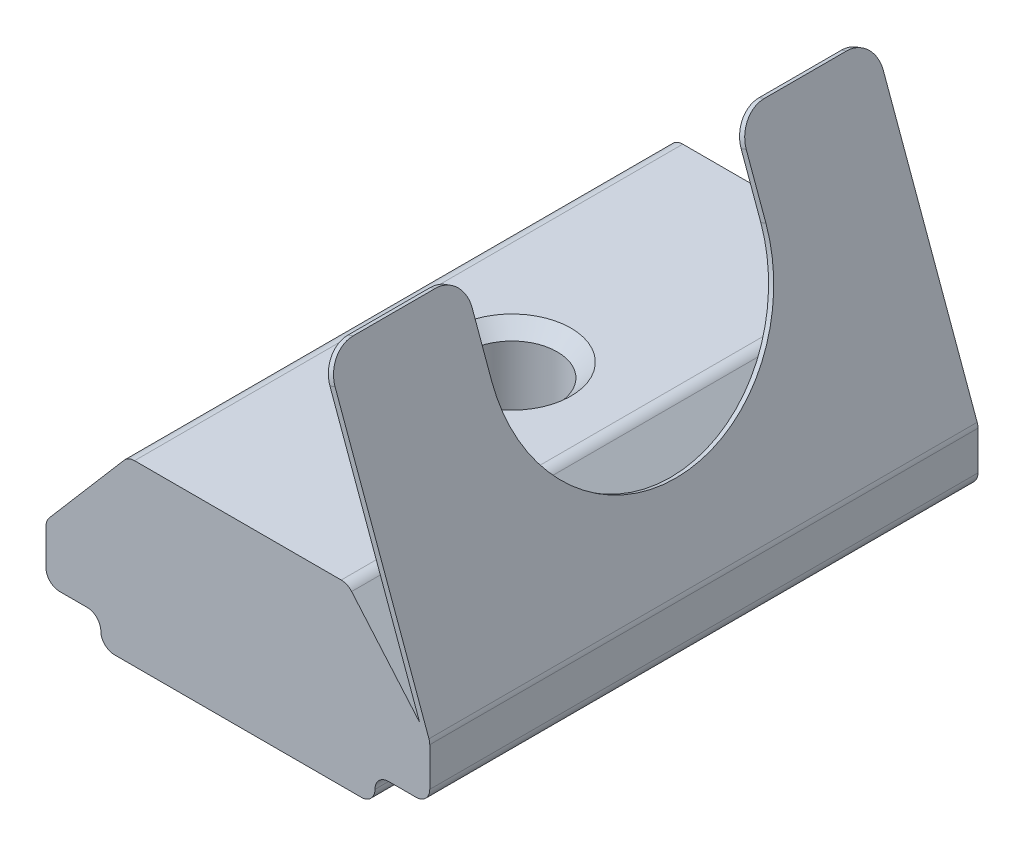
ISO-10303-21;
HEADER;
FILE_DESCRIPTION(('STEP AP214'),'2;1');
FILE_NAME('part.step','',(''),(''),'','','');
FILE_SCHEMA(('AUTOMOTIVE_DESIGN { 1 0 10303 214 1 1 1 1 }'));
ENDSEC;
DATA;
#1=APPLICATION_CONTEXT('core data for automotive mechanical design processes');
#2=APPLICATION_PROTOCOL_DEFINITION('international standard','automotive_design',2000,#1);
#3=PRODUCT_CONTEXT('',#1,'mechanical');
#4=PRODUCT('Part','Part','',(#3));
#5=PRODUCT_RELATED_PRODUCT_CATEGORY('part','',(#4));
#6=PRODUCT_DEFINITION_FORMATION('','',#4);
#7=PRODUCT_DEFINITION_CONTEXT('part definition',#1,'design');
#8=PRODUCT_DEFINITION('design','',#6,#7);
#9=PRODUCT_DEFINITION_SHAPE('','',#8);
#10=(LENGTH_UNIT() NAMED_UNIT(*) SI_UNIT(.MILLI.,.METRE.));
#11=(NAMED_UNIT(*) PLANE_ANGLE_UNIT() SI_UNIT($,.RADIAN.));
#12=(NAMED_UNIT(*) SI_UNIT($,.STERADIAN.) SOLID_ANGLE_UNIT());
#13=UNCERTAINTY_MEASURE_WITH_UNIT(LENGTH_MEASURE(1.E-05),#10,'distance_accuracy_value','');
#14=(GEOMETRIC_REPRESENTATION_CONTEXT(3) GLOBAL_UNCERTAINTY_ASSIGNED_CONTEXT((#13)) GLOBAL_UNIT_ASSIGNED_CONTEXT((#10,
#11,#12)) REPRESENTATION_CONTEXT('',''));
#15=CARTESIAN_POINT('',(0.,0.,0.));
#16=DIRECTION('',(0.,0.,1.));
#17=DIRECTION('',(1.,0.,0.));
#18=AXIS2_PLACEMENT_3D('',#15,#16,#17);
#19=CARTESIAN_POINT('',(1.88670694780785,8.66504489675684,9.36743547306151));
#20=DIRECTION('',(0.342020143325663,-0.93969262078591,0.));
#21=DIRECTION('',(0.93969262078591,0.342020143325663,0.));
#22=AXIS2_PLACEMENT_3D('',#19,#20,#21);
#23=PLANE('',#22);
#24=DIRECTION('',(0.,0.,-1.));
#25=VECTOR('',#24,1.);
#26=CARTESIAN_POINT('',(1.88670694780785,8.66504489675684,9.36743547306151));
#27=LINE('',#26,#25);
#28=CARTESIAN_POINT('',(1.88670694780785,8.66504489675684,-6.63256452693849));
#29=VERTEX_POINT('',#28);
#30=CARTESIAN_POINT('',(1.88670694780785,8.66504489675684,-9.63256452693849));
#31=VERTEX_POINT('',#30);
#32=EDGE_CURVE('E258',#29,#31,#27,.T.);
#33=ORIENTED_EDGE('',*,*,#32,.T.);
#34=DIRECTION('',(-0.93969262078591,-0.342020143325663,0.));
#35=VECTOR('',#34,1.);
#36=CARTESIAN_POINT('',(1.88670694780785,8.66504489675684,-9.63256452693849));
#37=LINE('',#36,#35);
#38=CARTESIAN_POINT('',(1.69876842365067,8.59664086809171,-9.63256452693849));
#39=VERTEX_POINT('',#38);
#40=EDGE_CURVE('E412',#31,#39,#37,.T.);
#41=ORIENTED_EDGE('',*,*,#40,.T.);
#42=DIRECTION('',(0.,0.,-1.));
#43=VECTOR('',#42,1.);
#44=CARTESIAN_POINT('',(1.69876842365067,8.59664086809171,9.36743547306151));
#45=LINE('',#44,#43);
#46=CARTESIAN_POINT('',(1.69876842365067,8.59664086809171,-6.63256452693849));
#47=VERTEX_POINT('',#46);
#48=EDGE_CURVE('E254',#47,#39,#45,.T.);
#49=ORIENTED_EDGE('',*,*,#48,.F.);
#50=DIRECTION('',(0.93969262078591,0.342020143325663,0.));
#51=VECTOR('',#50,1.);
#52=CARTESIAN_POINT('',(1.88670694780785,8.66504489675684,-6.63256452693849));
#53=LINE('',#52,#51);
#54=EDGE_CURVE('E409',#47,#29,#53,.T.);
#55=ORIENTED_EDGE('',*,*,#54,.T.);
#56=EDGE_LOOP('',(#33,#41,#49,#55));
#57=FACE_BOUND('',#56,.T.);
#58=ADVANCED_FACE('F16',(#57),#23,.F.);
#59=CARTESIAN_POINT('',(-6.31686946127729,-4.76554319396677,9.36743547306151));
#60=DIRECTION('',(0.,1.,0.));
#61=DIRECTION('',(0.,0.,1.));
#62=AXIS2_PLACEMENT_3D('',#59,#60,#61);
#63=PLANE('',#62);
#64=CARTESIAN_POINT('',(-1.31686946127729,-4.76554319396677,-0.632564526938495));
#65=DIRECTION('',(0.,1.,0.));
#66=DIRECTION('',(0.,0.,1.));
#67=AXIS2_PLACEMENT_3D('',#64,#65,#66);
#68=CIRCLE('',#67,2.15);
#69=CARTESIAN_POINT('',(-1.31686946127729,-4.76554319396677,1.5174354730615));
#70=VERTEX_POINT('',#69);
#71=EDGE_CURVE('E396',#70,#70,#68,.T.);
#72=ORIENTED_EDGE('',*,*,#71,.T.);
#73=EDGE_LOOP('',(#72));
#74=FACE_BOUND('',#73,.T.);
#75=DIRECTION('',(1.,0.,0.));
#76=VECTOR('',#75,1.);
#77=CARTESIAN_POINT('',(-6.31686946127729,-4.76554319396677,9.36743547306151));
#78=LINE('',#77,#76);
#79=CARTESIAN_POINT('',(-5.81686946127729,-4.76554319396677,9.36743547306151));
#80=VERTEX_POINT('',#79);
#81=CARTESIAN_POINT('',(3.18313053872271,-4.76554319396677,9.36743547306151));
#82=VERTEX_POINT('',#81);
#83=EDGE_CURVE('E262',#80,#82,#78,.T.);
#84=ORIENTED_EDGE('',*,*,#83,.F.);
#85=DIRECTION('',(0.,0.,-1.));
#86=VECTOR('',#85,1.);
#87=CARTESIAN_POINT('',(-5.81686946127729,-4.76554319396677,9.36743547306151));
#88=LINE('',#87,#86);
#89=CARTESIAN_POINT('',(-5.81686946127729,-4.76554319396677,-10.6325645269385));
#90=VERTEX_POINT('',#89);
#91=EDGE_CURVE('E351',#80,#90,#88,.T.);
#92=ORIENTED_EDGE('',*,*,#91,.T.);
#93=DIRECTION('',(1.,0.,0.));
#94=VECTOR('',#93,1.);
#95=CARTESIAN_POINT('',(-6.31686946127729,-4.76554319396677,-10.6325645269385));
#96=LINE('',#95,#94);
#97=CARTESIAN_POINT('',(3.18313053872271,-4.76554319396677,-10.6325645269385));
#98=VERTEX_POINT('',#97);
#99=EDGE_CURVE('E261',#90,#98,#96,.T.);
#100=ORIENTED_EDGE('',*,*,#99,.T.);
#101=DIRECTION('',(0.,0.,-1.));
#102=VECTOR('',#101,1.);
#103=CARTESIAN_POINT('',(3.18313053872271,-4.76554319396677,9.36743547306151));
#104=LINE('',#103,#102);
#105=EDGE_CURVE('E349',#98,#82,#104,.F.);
#106=ORIENTED_EDGE('',*,*,#105,.T.);
#107=EDGE_LOOP('',(#84,#92,#100,#106));
#108=FACE_BOUND('',#107,.T.);
#109=ADVANCED_FACE('F505',(#74,#108),#63,.F.);
#110=CARTESIAN_POINT('',(3.68313053872271,-3.76554319396676,9.36743547306151));
#111=DIRECTION('',(0.,1.,0.));
#112=DIRECTION('',(0.,0.,1.));
#113=AXIS2_PLACEMENT_3D('',#110,#111,#112);
#114=PLANE('',#113);
#115=DIRECTION('',(1.,0.,0.));
#116=VECTOR('',#115,1.);
#117=CARTESIAN_POINT('',(3.68313053872271,-3.76554319396676,9.36743547306151));
#118=LINE('',#117,#116);
#119=CARTESIAN_POINT('',(4.18313053872271,-3.76554319396676,9.36743547306151));
#120=VERTEX_POINT('',#119);
#121=CARTESIAN_POINT('',(5.18313053872271,-3.76554319396676,9.36743547306151));
#122=VERTEX_POINT('',#121);
#123=EDGE_CURVE('E265',#120,#122,#118,.T.);
#124=ORIENTED_EDGE('',*,*,#123,.F.);
#125=DIRECTION('',(0.,0.,-1.));
#126=VECTOR('',#125,1.);
#127=CARTESIAN_POINT('',(4.18313053872271,-3.76554319396676,-10.6325645269385));
#128=LINE('',#127,#126);
#129=CARTESIAN_POINT('',(4.18313053872271,-3.76554319396676,-10.6325645269385));
#130=VERTEX_POINT('',#129);
#131=EDGE_CURVE('E383',#120,#130,#128,.T.);
#132=ORIENTED_EDGE('',*,*,#131,.T.);
#133=DIRECTION('',(1.,0.,0.));
#134=VECTOR('',#133,1.);
#135=CARTESIAN_POINT('',(3.68313053872271,-3.76554319396676,-10.6325645269385));
#136=LINE('',#135,#134);
#137=CARTESIAN_POINT('',(5.18313053872271,-3.76554319396676,-10.6325645269385));
#138=VERTEX_POINT('',#137);
#139=EDGE_CURVE('E289',#130,#138,#136,.T.);
#140=ORIENTED_EDGE('',*,*,#139,.T.);
#141=DIRECTION('',(0.,0.,-1.));
#142=VECTOR('',#141,1.);
#143=CARTESIAN_POINT('',(5.18313053872271,-3.76554319396676,9.36743547306151));
#144=LINE('',#143,#142);
#145=EDGE_CURVE('E377',#138,#122,#144,.F.);
#146=ORIENTED_EDGE('',*,*,#145,.T.);
#147=EDGE_LOOP('',(#124,#132,#140,#146));
#148=FACE_BOUND('',#147,.T.);
#149=ADVANCED_FACE('F517',(#148),#114,.F.);
#150=CARTESIAN_POINT('',(5.68313053872271,-3.76554319396676,9.36743547306151));
#151=DIRECTION('',(-1.,0.,0.));
#152=DIRECTION('',(0.,0.,1.));
#153=AXIS2_PLACEMENT_3D('',#150,#151,#152);
#154=PLANE('',#153);
#155=DIRECTION('',(0.,1.,0.));
#156=VECTOR('',#155,1.);
#157=CARTESIAN_POINT('',(5.68313053872271,-3.76554319396676,-10.6325645269385));
#158=LINE('',#157,#156);
#159=CARTESIAN_POINT('',(5.68313053872271,-3.26554319396676,-10.6325645269385));
#160=VERTEX_POINT('',#159);
#161=CARTESIAN_POINT('',(5.68313053872271,-1.853706684321,-10.6325645269385));
#162=VERTEX_POINT('',#161);
#163=EDGE_CURVE('E291',#160,#162,#158,.T.);
#164=ORIENTED_EDGE('',*,*,#163,.T.);
#165=DIRECTION('',(0.,0.,-1.));
#166=VECTOR('',#165,1.);
#167=CARTESIAN_POINT('',(5.68313053872271,-1.853706684321,9.36743547306151));
#168=LINE('',#167,#166);
#169=CARTESIAN_POINT('',(5.68313053872271,-1.853706684321,9.36743547306151));
#170=VERTEX_POINT('',#169);
#171=EDGE_CURVE('E331',#162,#170,#168,.F.);
#172=ORIENTED_EDGE('',*,*,#171,.T.);
#173=DIRECTION('',(0.,1.,0.));
#174=VECTOR('',#173,1.);
#175=CARTESIAN_POINT('',(5.68313053872271,-3.76554319396676,9.36743547306151));
#176=LINE('',#175,#174);
#177=CARTESIAN_POINT('',(5.68313053872271,-3.26554319396676,9.36743547306151));
#178=VERTEX_POINT('',#177);
#179=EDGE_CURVE('E268',#178,#170,#176,.T.);
#180=ORIENTED_EDGE('',*,*,#179,.F.);
#181=DIRECTION('',(0.,0.,-1.));
#182=VECTOR('',#181,1.);
#183=CARTESIAN_POINT('',(5.68313053872271,-3.26554319396676,9.36743547306151));
#184=LINE('',#183,#182);
#185=EDGE_CURVE('E328',#178,#160,#184,.T.);
#186=ORIENTED_EDGE('',*,*,#185,.T.);
#187=EDGE_LOOP('',(#164,#172,#180,#186));
#188=FACE_BOUND('',#187,.T.);
#189=ADVANCED_FACE('F529',(#188),#154,.F.);
#190=CARTESIAN_POINT('',(5.68313053872271,-1.76554319396676,9.36743547306151));
#191=DIRECTION('',(-0.759256602365296,-0.650791373455969,0.));
#192=DIRECTION('',(0.650791373455969,-0.759256602365296,0.));
#193=AXIS2_PLACEMENT_3D('',#190,#191,#192);
#194=PLANE('',#193);
#195=DIRECTION('',(-0.650791373455969,0.759256602365296,0.));
#196=VECTOR('',#195,1.);
#197=CARTESIAN_POINT('',(5.68313053872271,-1.76554319396676,-10.6325645269385));
#198=LINE('',#197,#196);
#199=CARTESIAN_POINT('',(5.31321853059567,-1.33397918448522,-10.6325645269385));
#200=VERTEX_POINT('',#199);
#201=CARTESIAN_POINT('',(2.83279137867015,1.55985249276122,-10.6325645269385));
#202=VERTEX_POINT('',#201);
#203=EDGE_CURVE('E294',#200,#202,#198,.T.);
#204=ORIENTED_EDGE('',*,*,#203,.T.);
#205=DIRECTION('',(0.,0.,-1.));
#206=VECTOR('',#205,1.);
#207=CARTESIAN_POINT('',(2.83279137867015,1.55985249276122,9.36743547306151));
#208=LINE('',#207,#206);
#209=CARTESIAN_POINT('',(2.83279137867015,1.55985249276122,9.36743547306151));
#210=VERTEX_POINT('',#209);
#211=EDGE_CURVE('E375',#202,#210,#208,.F.);
#212=ORIENTED_EDGE('',*,*,#211,.T.);
#213=DIRECTION('',(-0.650791373455969,0.759256602365296,0.));
#214=VECTOR('',#213,1.);
#215=CARTESIAN_POINT('',(5.68313053872271,-1.76554319396676,9.36743547306151));
#216=LINE('',#215,#214);
#217=CARTESIAN_POINT('',(5.31321853059567,-1.33397918448522,9.36743547306151));
#218=VERTEX_POINT('',#217);
#219=EDGE_CURVE('E271',#218,#210,#216,.T.);
#220=ORIENTED_EDGE('',*,*,#219,.F.);
#221=DIRECTION('',(0.,0.,-1.));
#222=VECTOR('',#221,1.);
#223=CARTESIAN_POINT('',(5.31321853059567,-1.33397918448522,9.36743547306151));
#224=LINE('',#223,#222);
#225=EDGE_CURVE('E248',#218,#200,#224,.T.);
#226=ORIENTED_EDGE('',*,*,#225,.T.);
#227=EDGE_LOOP('',(#204,#212,#220,#226));
#228=FACE_BOUND('',#227,.T.);
#229=ADVANCED_FACE('F454',(#228),#194,.F.);
#230=CARTESIAN_POINT('',(2.68313053872271,1.73445680603323,9.36743547306151));
#231=DIRECTION('',(0.,-1.,0.));
#232=DIRECTION('',(0.,0.,-1.));
#233=AXIS2_PLACEMENT_3D('',#230,#231,#232);
#234=PLANE('',#233);
#235=CARTESIAN_POINT('',(-1.31686946127729,1.73445680603323,-0.632564526938495));
#236=DIRECTION('',(0.,-1.,0.));
#237=DIRECTION('',(0.,0.,-1.));
#238=AXIS2_PLACEMENT_3D('',#235,#236,#237);
#239=CIRCLE('',#238,2.15000000000001);
#240=CARTESIAN_POINT('',(-1.31686946127729,1.73445680603323,-2.7825645269385));
#241=VERTEX_POINT('',#240);
#242=EDGE_CURVE('E405',#241,#241,#239,.T.);
#243=ORIENTED_EDGE('',*,*,#242,.T.);
#244=EDGE_LOOP('',(#243));
#245=FACE_BOUND('',#244,.T.);
#246=DIRECTION('',(-1.,0.,0.));
#247=VECTOR('',#246,1.);
#248=CARTESIAN_POINT('',(2.68313053872271,1.73445680603323,-10.6325645269385));
#249=LINE('',#248,#247);
#250=CARTESIAN_POINT('',(2.4531630774875,1.73445680603323,-10.6325645269385));
#251=VERTEX_POINT('',#250);
#252=CARTESIAN_POINT('',(-5.08690200004209,1.73445680603323,-10.6325645269385));
#253=VERTEX_POINT('',#252);
#254=EDGE_CURVE('E297',#251,#253,#249,.T.);
#255=ORIENTED_EDGE('',*,*,#254,.T.);
#256=DIRECTION('',(0.,0.,-1.));
#257=VECTOR('',#256,1.);
#258=CARTESIAN_POINT('',(-5.08690200004209,1.73445680603323,9.36743547306151));
#259=LINE('',#258,#257);
#260=CARTESIAN_POINT('',(-5.08690200004209,1.73445680603323,9.36743547306151));
#261=VERTEX_POINT('',#260);
#262=EDGE_CURVE('E373',#253,#261,#259,.F.);
#263=ORIENTED_EDGE('',*,*,#262,.T.);
#264=DIRECTION('',(-1.,0.,0.));
#265=VECTOR('',#264,1.);
#266=CARTESIAN_POINT('',(2.68313053872271,1.73445680603323,9.36743547306151));
#267=LINE('',#266,#265);
#268=CARTESIAN_POINT('',(2.4531630774875,1.73445680603323,9.36743547306151));
#269=VERTEX_POINT('',#268);
#270=EDGE_CURVE('E274',#269,#261,#267,.T.);
#271=ORIENTED_EDGE('',*,*,#270,.F.);
#272=DIRECTION('',(0.,0.,-1.));
#273=VECTOR('',#272,1.);
#274=CARTESIAN_POINT('',(2.4531630774875,1.73445680603323,9.36743547306151));
#275=LINE('',#274,#273);
#276=EDGE_CURVE('E370',#269,#251,#275,.T.);
#277=ORIENTED_EDGE('',*,*,#276,.T.);
#278=EDGE_LOOP('',(#255,#263,#271,#277));
#279=FACE_BOUND('',#278,.T.);
#280=ADVANCED_FACE('F463',(#245,#279),#234,.F.);
#281=CARTESIAN_POINT('',(-8.31686946127729,-1.76554319396676,9.36743547306151));
#282=DIRECTION('',(0.759256602365296,-0.650791373455969,0.));
#283=DIRECTION('',(0.650791373455969,0.759256602365296,0.));
#284=AXIS2_PLACEMENT_3D('',#281,#282,#283);
#285=PLANE('',#284);
#286=DIRECTION('',(-0.650791373455969,-0.759256602365296,0.));
#287=VECTOR('',#286,1.);
#288=CARTESIAN_POINT('',(-8.31686946127729,-1.76554319396676,-10.6325645269385));
#289=LINE('',#288,#287);
#290=CARTESIAN_POINT('',(-5.46653030122474,1.55985249276122,-10.6325645269385));
#291=VERTEX_POINT('',#290);
#292=CARTESIAN_POINT('',(-8.19649776245994,-1.62510954534652,-10.6325645269385));
#293=VERTEX_POINT('',#292);
#294=EDGE_CURVE('E300',#291,#293,#289,.T.);
#295=ORIENTED_EDGE('',*,*,#294,.T.);
#296=DIRECTION('',(0.,0.,-1.));
#297=VECTOR('',#296,1.);
#298=CARTESIAN_POINT('',(-8.19649776245994,-1.62510954534652,9.36743547306151));
#299=LINE('',#298,#297);
#300=CARTESIAN_POINT('',(-8.19649776245994,-1.62510954534652,9.36743547306151));
#301=VERTEX_POINT('',#300);
#302=EDGE_CURVE('E368',#293,#301,#299,.F.);
#303=ORIENTED_EDGE('',*,*,#302,.T.);
#304=DIRECTION('',(-0.650791373455969,-0.759256602365296,0.));
#305=VECTOR('',#304,1.);
#306=CARTESIAN_POINT('',(-8.31686946127729,-1.76554319396676,9.36743547306151));
#307=LINE('',#306,#305);
#308=CARTESIAN_POINT('',(-5.46653030122474,1.55985249276122,9.36743547306151));
#309=VERTEX_POINT('',#308);
#310=EDGE_CURVE('E277',#309,#301,#307,.T.);
#311=ORIENTED_EDGE('',*,*,#310,.F.);
#312=DIRECTION('',(0.,0.,-1.));
#313=VECTOR('',#312,1.);
#314=CARTESIAN_POINT('',(-5.46653030122474,1.55985249276122,9.36743547306151));
#315=LINE('',#314,#313);
#316=EDGE_CURVE('E365',#309,#291,#315,.T.);
#317=ORIENTED_EDGE('',*,*,#316,.T.);
#318=EDGE_LOOP('',(#295,#303,#311,#317));
#319=FACE_BOUND('',#318,.T.);
#320=ADVANCED_FACE('F474',(#319),#285,.F.);
#321=CARTESIAN_POINT('',(-8.31686946127729,-3.76554319396676,9.36743547306151));
#322=DIRECTION('',(1.,0.,0.));
#323=DIRECTION('',(0.,0.,-1.));
#324=AXIS2_PLACEMENT_3D('',#321,#322,#323);
#325=PLANE('',#324);
#326=DIRECTION('',(0.,-1.,0.));
#327=VECTOR('',#326,1.);
#328=CARTESIAN_POINT('',(-8.31686946127729,-3.76554319396676,-10.6325645269385));
#329=LINE('',#328,#327);
#330=CARTESIAN_POINT('',(-8.31686946127729,-1.95050523207451,-10.6325645269385));
#331=VERTEX_POINT('',#330);
#332=CARTESIAN_POINT('',(-8.31686946127729,-3.26554319396676,-10.6325645269385));
#333=VERTEX_POINT('',#332);
#334=EDGE_CURVE('E303',#331,#333,#329,.T.);
#335=ORIENTED_EDGE('',*,*,#334,.T.);
#336=DIRECTION('',(0.,0.,-1.));
#337=VECTOR('',#336,1.);
#338=CARTESIAN_POINT('',(-8.31686946127729,-3.26554319396676,9.36743547306151));
#339=LINE('',#338,#337);
#340=CARTESIAN_POINT('',(-8.31686946127729,-3.26554319396676,9.36743547306151));
#341=VERTEX_POINT('',#340);
#342=EDGE_CURVE('E363',#333,#341,#339,.F.);
#343=ORIENTED_EDGE('',*,*,#342,.T.);
#344=DIRECTION('',(0.,-1.,0.));
#345=VECTOR('',#344,1.);
#346=CARTESIAN_POINT('',(-8.31686946127729,-3.76554319396676,9.36743547306151));
#347=LINE('',#346,#345);
#348=CARTESIAN_POINT('',(-8.31686946127729,-1.95050523207451,9.36743547306151));
#349=VERTEX_POINT('',#348);
#350=EDGE_CURVE('E280',#349,#341,#347,.T.);
#351=ORIENTED_EDGE('',*,*,#350,.F.);
#352=DIRECTION('',(0.,0.,-1.));
#353=VECTOR('',#352,1.);
#354=CARTESIAN_POINT('',(-8.31686946127729,-1.95050523207451,9.36743547306151));
#355=LINE('',#354,#353);
#356=EDGE_CURVE('E360',#349,#331,#355,.T.);
#357=ORIENTED_EDGE('',*,*,#356,.T.);
#358=EDGE_LOOP('',(#335,#343,#351,#357));
#359=FACE_BOUND('',#358,.T.);
#360=ADVANCED_FACE('F483',(#359),#325,.F.);
#361=CARTESIAN_POINT('',(-8.31686946127729,-3.76554319396676,9.36743547306151));
#362=DIRECTION('',(0.,1.,0.));
#363=DIRECTION('',(0.,0.,1.));
#364=AXIS2_PLACEMENT_3D('',#361,#362,#363);
#365=PLANE('',#364);
#366=DIRECTION('',(1.,0.,0.));
#367=VECTOR('',#366,1.);
#368=CARTESIAN_POINT('',(-8.31686946127729,-3.76554319396676,-10.6325645269385));
#369=LINE('',#368,#367);
#370=CARTESIAN_POINT('',(-7.81686946127729,-3.76554319396676,-10.6325645269385));
#371=VERTEX_POINT('',#370);
#372=CARTESIAN_POINT('',(-6.81686946127729,-3.76554319396676,-10.6325645269385));
#373=VERTEX_POINT('',#372);
#374=EDGE_CURVE('E266',#371,#373,#369,.T.);
#375=ORIENTED_EDGE('',*,*,#374,.T.);
#376=DIRECTION('',(0.,0.,-1.));
#377=VECTOR('',#376,1.);
#378=CARTESIAN_POINT('',(-6.81686946127729,-3.76554319396676,9.36743547306151));
#379=LINE('',#378,#377);
#380=CARTESIAN_POINT('',(-6.81686946127729,-3.76554319396676,9.36743547306151));
#381=VERTEX_POINT('',#380);
#382=EDGE_CURVE('E386',#373,#381,#379,.F.);
#383=ORIENTED_EDGE('',*,*,#382,.T.);
#384=DIRECTION('',(1.,0.,0.));
#385=VECTOR('',#384,1.);
#386=CARTESIAN_POINT('',(-8.31686946127729,-3.76554319396676,9.36743547306151));
#387=LINE('',#386,#385);
#388=CARTESIAN_POINT('',(-7.81686946127729,-3.76554319396676,9.36743547306151));
#389=VERTEX_POINT('',#388);
#390=EDGE_CURVE('E283',#389,#381,#387,.T.);
#391=ORIENTED_EDGE('',*,*,#390,.F.);
#392=DIRECTION('',(0.,0.,-1.));
#393=VECTOR('',#392,1.);
#394=CARTESIAN_POINT('',(-7.81686946127729,-3.76554319396676,9.36743547306151));
#395=LINE('',#394,#393);
#396=EDGE_CURVE('E357',#389,#371,#395,.T.);
#397=ORIENTED_EDGE('',*,*,#396,.T.);
#398=EDGE_LOOP('',(#375,#383,#391,#397));
#399=FACE_BOUND('',#398,.T.);
#400=ADVANCED_FACE('F492',(#399),#365,.F.);
#401=CARTESIAN_POINT('',(-1.31686946127729,-4.76554319396677,9.36743547306151));
#402=DIRECTION('',(0.,0.,1.));
#403=DIRECTION('',(1.,0.,0.));
#404=AXIS2_PLACEMENT_3D('',#401,#402,#403);
#405=PLANE('',#404);
#406=DIRECTION('',(-0.342020143325663,0.939692620785911,0.));
#407=VECTOR('',#406,1.);
#408=CARTESIAN_POINT('',(5.68313053872271,-1.76554319396676,9.36743547306151));
#409=LINE('',#408,#407);
#410=CARTESIAN_POINT('',(5.65297684911566,-1.68269661265817,9.36743547306151));
#411=VERTEX_POINT('',#410);
#412=CARTESIAN_POINT('',(2.22872709113351,7.72535227597093,9.36743547306151));
#413=VERTEX_POINT('',#412);
#414=EDGE_CURVE('E243',#411,#413,#409,.T.);
#415=ORIENTED_EDGE('',*,*,#414,.T.);
#416=DIRECTION('',(-0.93969262078591,-0.342020143325663,0.));
#417=VECTOR('',#416,1.);
#418=CARTESIAN_POINT('',(2.04078856697633,7.6569482473058,9.36743547306151));
#419=LINE('',#418,#417);
#420=CARTESIAN_POINT('',(2.04078856697633,7.6569482473058,9.36743547306151));
#421=VERTEX_POINT('',#420);
#422=EDGE_CURVE('E432',#413,#421,#419,.T.);
#423=ORIENTED_EDGE('',*,*,#422,.T.);
#424=DIRECTION('',(0.342020143325663,-0.939692620785911,0.));
#425=VECTOR('',#424,1.);
#426=CARTESIAN_POINT('',(1.69876842365067,8.59664086809171,9.36743547306151));
#427=LINE('',#426,#425);
#428=EDGE_CURVE('E245',#421,#218,#427,.T.);
#429=ORIENTED_EDGE('',*,*,#428,.T.);
#430=ORIENTED_EDGE('',*,*,#219,.T.);
#431=CARTESIAN_POINT('',(2.4531630774875,1.23445680603323,9.36743547306151));
#432=DIRECTION('',(0.,0.,1.));
#433=DIRECTION('',(1.,0.,0.));
#434=AXIS2_PLACEMENT_3D('',#431,#432,#433);
#435=CIRCLE('',#434,0.5);
#436=EDGE_CURVE('E337',#210,#269,#435,.T.);
#437=ORIENTED_EDGE('',*,*,#436,.T.);
#438=ORIENTED_EDGE('',*,*,#270,.T.);
#439=CARTESIAN_POINT('',(-5.08690200004209,1.23445680603323,9.36743547306151));
#440=DIRECTION('',(0.,0.,1.));
#441=DIRECTION('',(1.,0.,0.));
#442=AXIS2_PLACEMENT_3D('',#439,#440,#441);
#443=CIRCLE('',#442,0.5);
#444=EDGE_CURVE('E339',#261,#309,#443,.T.);
#445=ORIENTED_EDGE('',*,*,#444,.T.);
#446=ORIENTED_EDGE('',*,*,#310,.T.);
#447=CARTESIAN_POINT('',(-7.81686946127729,-1.95050523207451,9.36743547306151));
#448=DIRECTION('',(0.,0.,1.));
#449=DIRECTION('',(1.,0.,0.));
#450=AXIS2_PLACEMENT_3D('',#447,#448,#449);
#451=CIRCLE('',#450,0.5);
#452=EDGE_CURVE('E341',#301,#349,#451,.T.);
#453=ORIENTED_EDGE('',*,*,#452,.T.);
#454=ORIENTED_EDGE('',*,*,#350,.T.);
#455=CARTESIAN_POINT('',(-7.81686946127729,-3.26554319396676,9.36743547306151));
#456=DIRECTION('',(0.,0.,1.));
#457=DIRECTION('',(1.,0.,0.));
#458=AXIS2_PLACEMENT_3D('',#455,#456,#457);
#459=CIRCLE('',#458,0.5);
#460=EDGE_CURVE('E343',#341,#389,#459,.T.);
#461=ORIENTED_EDGE('',*,*,#460,.T.);
#462=ORIENTED_EDGE('',*,*,#390,.T.);
#463=CARTESIAN_POINT('',(-6.81686946127729,-4.26554319396676,9.36743547306151));
#464=DIRECTION('',(0.,0.,1.));
#465=DIRECTION('',(1.,0.,0.));
#466=AXIS2_PLACEMENT_3D('',#463,#464,#465);
#467=CIRCLE('',#466,0.5);
#468=CARTESIAN_POINT('',(-6.31686946127729,-4.26554319396676,9.36743547306151));
#469=VERTEX_POINT('',#468);
#470=EDGE_CURVE('E394',#381,#469,#467,.F.);
#471=ORIENTED_EDGE('',*,*,#470,.T.);
#472=CARTESIAN_POINT('',(-5.81686946127729,-4.26554319396676,9.36743547306151));
#473=DIRECTION('',(0.,0.,1.));
#474=DIRECTION('',(1.,0.,0.));
#475=AXIS2_PLACEMENT_3D('',#472,#473,#474);
#476=CIRCLE('',#475,0.5);
#477=EDGE_CURVE('E345',#469,#80,#476,.T.);
#478=ORIENTED_EDGE('',*,*,#477,.T.);
#479=ORIENTED_EDGE('',*,*,#83,.T.);
#480=CARTESIAN_POINT('',(3.18313053872271,-4.26554319396676,9.36743547306151));
#481=DIRECTION('',(0.,0.,1.));
#482=DIRECTION('',(1.,0.,0.));
#483=AXIS2_PLACEMENT_3D('',#480,#481,#482);
#484=CIRCLE('',#483,0.5);
#485=CARTESIAN_POINT('',(3.68313053872271,-4.26554319396676,9.36743547306151));
#486=VERTEX_POINT('',#485);
#487=EDGE_CURVE('E333',#82,#486,#484,.T.);
#488=ORIENTED_EDGE('',*,*,#487,.T.);
#489=CARTESIAN_POINT('',(4.18313053872271,-4.26554319396676,9.36743547306151));
#490=DIRECTION('',(0.,0.,1.));
#491=DIRECTION('',(1.,0.,0.));
#492=AXIS2_PLACEMENT_3D('',#489,#490,#491);
#493=CIRCLE('',#492,0.5);
#494=EDGE_CURVE('E390',#486,#120,#493,.F.);
#495=ORIENTED_EDGE('',*,*,#494,.T.);
#496=ORIENTED_EDGE('',*,*,#123,.T.);
#497=CARTESIAN_POINT('',(5.18313053872271,-3.26554319396676,9.36743547306151));
#498=DIRECTION('',(0.,0.,1.));
#499=DIRECTION('',(1.,0.,0.));
#500=AXIS2_PLACEMENT_3D('',#497,#498,#499);
#501=CIRCLE('',#500,0.5);
#502=EDGE_CURVE('E335',#122,#178,#501,.T.);
#503=ORIENTED_EDGE('',*,*,#502,.T.);
#504=ORIENTED_EDGE('',*,*,#179,.T.);
#505=CARTESIAN_POINT('',(5.18313053872271,-1.853706684321,9.36743547306151));
#506=DIRECTION('',(0.,0.,1.));
#507=DIRECTION('',(1.,0.,0.));
#508=AXIS2_PLACEMENT_3D('',#505,#506,#507);
#509=CIRCLE('',#508,0.5);
#510=EDGE_CURVE('E347',#170,#411,#509,.T.);
#511=ORIENTED_EDGE('',*,*,#510,.T.);
#512=EDGE_LOOP('',(#415,#423,#429,#430,#437,#438,#445,#446,#453,#454,#461,#462,#471,#478,#479,
#488,#495,#496,#503,#504,#511));
#513=FACE_BOUND('',#512,.T.);
#514=ADVANCED_FACE('F448',(#513),#405,.T.);
#515=CARTESIAN_POINT('',(-1.31686946127729,-4.76554319396677,-10.6325645269385));
#516=DIRECTION('',(0.,0.,1.));
#517=DIRECTION('',(1.,0.,0.));
#518=AXIS2_PLACEMENT_3D('',#515,#516,#517);
#519=PLANE('',#518);
#520=DIRECTION('',(0.342020143325663,-0.939692620785911,0.));
#521=VECTOR('',#520,1.);
#522=CARTESIAN_POINT('',(1.69876842365067,8.59664086809171,-10.6325645269385));
#523=LINE('',#522,#521);
#524=CARTESIAN_POINT('',(2.04078856697633,7.6569482473058,-10.6325645269385));
#525=VERTEX_POINT('',#524);
#526=EDGE_CURVE('E246',#525,#200,#523,.T.);
#527=ORIENTED_EDGE('',*,*,#526,.F.);
#528=DIRECTION('',(-0.93969262078591,-0.342020143325663,0.));
#529=VECTOR('',#528,1.);
#530=CARTESIAN_POINT('',(-4.91660987431273,5.12466230674655,-10.6325645269385));
#531=LINE('',#530,#529);
#532=CARTESIAN_POINT('',(2.22872709113351,7.72535227597093,-10.6325645269385));
#533=VERTEX_POINT('',#532);
#534=EDGE_CURVE('E423',#525,#533,#531,.F.);
#535=ORIENTED_EDGE('',*,*,#534,.T.);
#536=DIRECTION('',(-0.342020143325663,0.939692620785911,0.));
#537=VECTOR('',#536,1.);
#538=CARTESIAN_POINT('',(5.68313053872271,-1.76554319396676,-10.6325645269385));
#539=LINE('',#538,#537);
#540=CARTESIAN_POINT('',(5.65297684911566,-1.68269661265817,-10.6325645269385));
#541=VERTEX_POINT('',#540);
#542=EDGE_CURVE('E220',#541,#533,#539,.T.);
#543=ORIENTED_EDGE('',*,*,#542,.F.);
#544=CARTESIAN_POINT('',(5.18313053872271,-1.853706684321,-10.6325645269385));
#545=DIRECTION('',(0.,0.,1.));
#546=DIRECTION('',(1.,0.,0.));
#547=AXIS2_PLACEMENT_3D('',#544,#545,#546);
#548=CIRCLE('',#547,0.5);
#549=EDGE_CURVE('E326',#541,#162,#548,.F.);
#550=ORIENTED_EDGE('',*,*,#549,.T.);
#551=ORIENTED_EDGE('',*,*,#163,.F.);
#552=CARTESIAN_POINT('',(5.18313053872271,-3.26554319396676,-10.6325645269385));
#553=DIRECTION('',(0.,0.,1.));
#554=DIRECTION('',(1.,0.,0.));
#555=AXIS2_PLACEMENT_3D('',#552,#553,#554);
#556=CIRCLE('',#555,0.5);
#557=EDGE_CURVE('E312',#160,#138,#556,.F.);
#558=ORIENTED_EDGE('',*,*,#557,.T.);
#559=ORIENTED_EDGE('',*,*,#139,.F.);
#560=CARTESIAN_POINT('',(4.18313053872271,-4.26554319396676,-10.6325645269385));
#561=DIRECTION('',(0.,0.,1.));
#562=DIRECTION('',(1.,0.,0.));
#563=AXIS2_PLACEMENT_3D('',#560,#561,#562);
#564=CIRCLE('',#563,0.5);
#565=CARTESIAN_POINT('',(3.68313053872271,-4.26554319396676,-10.6325645269385));
#566=VERTEX_POINT('',#565);
#567=EDGE_CURVE('E388',#130,#566,#564,.T.);
#568=ORIENTED_EDGE('',*,*,#567,.T.);
#569=CARTESIAN_POINT('',(3.18313053872271,-4.26554319396676,-10.6325645269385));
#570=DIRECTION('',(0.,0.,1.));
#571=DIRECTION('',(1.,0.,0.));
#572=AXIS2_PLACEMENT_3D('',#569,#570,#571);
#573=CIRCLE('',#572,0.5);
#574=EDGE_CURVE('E310',#566,#98,#573,.F.);
#575=ORIENTED_EDGE('',*,*,#574,.T.);
#576=ORIENTED_EDGE('',*,*,#99,.F.);
#577=CARTESIAN_POINT('',(-5.81686946127729,-4.26554319396676,-10.6325645269385));
#578=DIRECTION('',(0.,0.,1.));
#579=DIRECTION('',(1.,0.,0.));
#580=AXIS2_PLACEMENT_3D('',#577,#578,#579);
#581=CIRCLE('',#580,0.5);
#582=CARTESIAN_POINT('',(-6.31686946127729,-4.26554319396676,-10.6325645269385));
#583=VERTEX_POINT('',#582);
#584=EDGE_CURVE('E323',#90,#583,#581,.F.);
#585=ORIENTED_EDGE('',*,*,#584,.T.);
#586=CARTESIAN_POINT('',(-6.81686946127729,-4.26554319396676,-10.6325645269385));
#587=DIRECTION('',(0.,0.,1.));
#588=DIRECTION('',(1.,0.,0.));
#589=AXIS2_PLACEMENT_3D('',#586,#587,#588);
#590=CIRCLE('',#589,0.5);
#591=EDGE_CURVE('E392',#583,#373,#590,.T.);
#592=ORIENTED_EDGE('',*,*,#591,.T.);
#593=ORIENTED_EDGE('',*,*,#374,.F.);
#594=CARTESIAN_POINT('',(-7.81686946127729,-3.26554319396676,-10.6325645269385));
#595=DIRECTION('',(0.,0.,1.));
#596=DIRECTION('',(1.,0.,0.));
#597=AXIS2_PLACEMENT_3D('',#594,#595,#596);
#598=CIRCLE('',#597,0.5);
#599=EDGE_CURVE('E321',#371,#333,#598,.F.);
#600=ORIENTED_EDGE('',*,*,#599,.T.);
#601=ORIENTED_EDGE('',*,*,#334,.F.);
#602=CARTESIAN_POINT('',(-7.81686946127729,-1.95050523207451,-10.6325645269385));
#603=DIRECTION('',(0.,0.,1.));
#604=DIRECTION('',(1.,0.,0.));
#605=AXIS2_PLACEMENT_3D('',#602,#603,#604);
#606=CIRCLE('',#605,0.5);
#607=EDGE_CURVE('E319',#331,#293,#606,.F.);
#608=ORIENTED_EDGE('',*,*,#607,.T.);
#609=ORIENTED_EDGE('',*,*,#294,.F.);
#610=CARTESIAN_POINT('',(-5.08690200004209,1.23445680603323,-10.6325645269385));
#611=DIRECTION('',(0.,0.,1.));
#612=DIRECTION('',(1.,0.,0.));
#613=AXIS2_PLACEMENT_3D('',#610,#611,#612);
#614=CIRCLE('',#613,0.5);
#615=EDGE_CURVE('E317',#291,#253,#614,.F.);
#616=ORIENTED_EDGE('',*,*,#615,.T.);
#617=ORIENTED_EDGE('',*,*,#254,.F.);
#618=CARTESIAN_POINT('',(2.4531630774875,1.23445680603323,-10.6325645269385));
#619=DIRECTION('',(0.,0.,1.));
#620=DIRECTION('',(1.,0.,0.));
#621=AXIS2_PLACEMENT_3D('',#618,#619,#620);
#622=CIRCLE('',#621,0.5);
#623=EDGE_CURVE('E315',#251,#202,#622,.F.);
#624=ORIENTED_EDGE('',*,*,#623,.T.);
#625=ORIENTED_EDGE('',*,*,#203,.F.);
#626=EDGE_LOOP('',(#527,#535,#543,#550,#551,#558,#559,#568,#575,#576,#585,#592,#593,#600,#601,
#608,#609,#616,#617,#624,#625));
#627=FACE_BOUND('',#626,.T.);
#628=ADVANCED_FACE('F466',(#627),#519,.F.);
#629=CARTESIAN_POINT('',(5.68313053872271,-1.76554319396676,9.36743547306151));
#630=DIRECTION('',(-0.93969262078591,-0.342020143325663,0.));
#631=DIRECTION('',(0.342020143325663,-0.939692620785911,0.));
#632=AXIS2_PLACEMENT_3D('',#629,#630,#631);
#633=PLANE('',#632);
#634=ORIENTED_EDGE('',*,*,#542,.T.);
#635=CARTESIAN_POINT('',(2.22872709113351,7.72535227597093,-9.63256452693849));
#636=DIRECTION('',(-0.93969262078591,-0.342020143325663,0.));
#637=DIRECTION('',(0.342020143325663,-0.939692620785911,0.));
#638=AXIS2_PLACEMENT_3D('',#635,#636,#637);
#639=CIRCLE('',#638,1.);
#640=EDGE_CURVE('E429',#533,#31,#639,.F.);
#641=ORIENTED_EDGE('',*,*,#640,.T.);
#642=ORIENTED_EDGE('',*,*,#32,.F.);
#643=CARTESIAN_POINT('',(2.22872709113351,7.72535227597093,-6.63256452693849));
#644=DIRECTION('',(-0.93969262078591,-0.342020143325663,0.));
#645=DIRECTION('',(0.342020143325663,-0.939692620785911,0.));
#646=AXIS2_PLACEMENT_3D('',#643,#644,#645);
#647=CIRCLE('',#646,1.);
#648=CARTESIAN_POINT('',(2.22872709113351,7.72535227597093,-5.63256452693849));
#649=VERTEX_POINT('',#648);
#650=EDGE_CURVE('E427',#29,#649,#647,.F.);
#651=ORIENTED_EDGE('',*,*,#650,.T.);
#652=DIRECTION('',(-0.342020143325663,0.93969262078591,0.));
#653=VECTOR('',#652,1.);
#654=CARTESIAN_POINT('',(1.23686867548909,10.4504608762501,-5.63256452693849));
#655=LINE('',#654,#653);
#656=CARTESIAN_POINT('',(2.9469693921174,5.75199777232052,-5.63256452693849));
#657=VERTEX_POINT('',#656);
#658=EDGE_CURVE('E235',#657,#649,#655,.T.);
#659=ORIENTED_EDGE('',*,*,#658,.F.);
#660=CARTESIAN_POINT('',(2.9469693921174,5.75199777232052,-0.632564526938495));
#661=DIRECTION('',(0.939692620785911,0.342020143325663,0.));
#662=DIRECTION('',(-0.342020143325663,0.939692620785911,0.));
#663=AXIS2_PLACEMENT_3D('',#660,#661,#662);
#664=CIRCLE('',#663,5.);
#665=CARTESIAN_POINT('',(2.9469693921174,5.75199777232052,4.3674354730615));
#666=VERTEX_POINT('',#665);
#667=EDGE_CURVE('E216',#666,#657,#664,.T.);
#668=ORIENTED_EDGE('',*,*,#667,.F.);
#669=DIRECTION('',(0.342020143325663,-0.93969262078591,0.));
#670=VECTOR('',#669,1.);
#671=CARTESIAN_POINT('',(1.23686867548909,10.4504608762501,4.3674354730615));
#672=LINE('',#671,#670);
#673=CARTESIAN_POINT('',(2.22872709113351,7.72535227597093,4.3674354730615));
#674=VERTEX_POINT('',#673);
#675=EDGE_CURVE('E239',#674,#666,#672,.T.);
#676=ORIENTED_EDGE('',*,*,#675,.F.);
#677=CARTESIAN_POINT('',(2.22872709113351,7.72535227597093,5.36743547306151));
#678=DIRECTION('',(-0.93969262078591,-0.342020143325663,0.));
#679=DIRECTION('',(0.342020143325663,-0.939692620785911,0.));
#680=AXIS2_PLACEMENT_3D('',#677,#678,#679);
#681=CIRCLE('',#680,1.);
#682=CARTESIAN_POINT('',(1.88670694780785,8.66504489675684,5.36743547306151));
#683=VERTEX_POINT('',#682);
#684=EDGE_CURVE('E37',#674,#683,#681,.F.);
#685=ORIENTED_EDGE('',*,*,#684,.T.);
#686=CARTESIAN_POINT('',(1.88670694780785,8.66504489675684,8.36743547306151));
#687=VERTEX_POINT('',#686);
#688=EDGE_CURVE('E259',#687,#683,#27,.T.);
#689=ORIENTED_EDGE('',*,*,#688,.F.);
#690=CARTESIAN_POINT('',(2.22872709113351,7.72535227597093,8.36743547306151));
#691=DIRECTION('',(-0.93969262078591,-0.342020143325663,0.));
#692=DIRECTION('',(0.342020143325663,-0.939692620785911,0.));
#693=AXIS2_PLACEMENT_3D('',#690,#691,#692);
#694=CIRCLE('',#693,1.);
#695=EDGE_CURVE('E31',#687,#413,#694,.F.);
#696=ORIENTED_EDGE('',*,*,#695,.T.);
#697=ORIENTED_EDGE('',*,*,#414,.F.);
#698=DIRECTION('',(0.,0.,-1.));
#699=VECTOR('',#698,1.);
#700=CARTESIAN_POINT('',(5.65297684911566,-1.68269661265817,9.36743547306151));
#701=LINE('',#700,#699);
#702=EDGE_CURVE('E286',#411,#541,#701,.T.);
#703=ORIENTED_EDGE('',*,*,#702,.T.);
#704=EDGE_LOOP('',(#634,#641,#642,#651,#659,#668,#676,#685,#689,#696,#697,#703));
#705=FACE_BOUND('',#704,.T.);
#706=ADVANCED_FACE('F443',(#705),#633,.F.);
#707=CARTESIAN_POINT('',(1.69876842365067,8.59664086809171,8.36743547306151));
#708=VERTEX_POINT('',#707);
#709=CARTESIAN_POINT('',(1.69876842365067,8.59664086809171,5.36743547306151));
#710=VERTEX_POINT('',#709);
#711=EDGE_CURVE('E255',#708,#710,#45,.T.);
#712=ORIENTED_EDGE('',*,*,#711,.F.);
#713=DIRECTION('',(-0.93969262078591,-0.342020143325663,0.));
#714=VECTOR('',#713,1.);
#715=CARTESIAN_POINT('',(1.88670694780785,8.66504489675684,8.36743547306151));
#716=LINE('',#715,#714);
#717=EDGE_CURVE('E24',#708,#687,#716,.F.);
#718=ORIENTED_EDGE('',*,*,#717,.T.);
#719=ORIENTED_EDGE('',*,*,#688,.T.);
#720=DIRECTION('',(-0.93969262078591,-0.342020143325663,0.));
#721=VECTOR('',#720,1.);
#722=CARTESIAN_POINT('',(1.88670694780785,8.66504489675684,5.36743547306151));
#723=LINE('',#722,#721);
#724=EDGE_CURVE('E435',#683,#710,#723,.T.);
#725=ORIENTED_EDGE('',*,*,#724,.T.);
#726=EDGE_LOOP('',(#712,#718,#719,#725));
#727=FACE_BOUND('',#726,.T.);
#728=ADVANCED_FACE('F440',(#727),#23,.F.);
#729=CARTESIAN_POINT('',(1.69876842365067,8.59664086809171,9.36743547306151));
#730=DIRECTION('',(0.939692620785911,0.342020143325663,0.));
#731=DIRECTION('',(-0.342020143325663,0.939692620785911,0.));
#732=AXIS2_PLACEMENT_3D('',#729,#730,#731);
#733=PLANE('',#732);
#734=ORIENTED_EDGE('',*,*,#48,.T.);
#735=CARTESIAN_POINT('',(2.04078856697633,7.6569482473058,-9.63256452693849));
#736=DIRECTION('',(0.939692620785911,0.342020143325663,0.));
#737=DIRECTION('',(-0.342020143325663,0.939692620785911,0.));
#738=AXIS2_PLACEMENT_3D('',#735,#736,#737);
#739=CIRCLE('',#738,1.);
#740=EDGE_CURVE('E421',#39,#525,#739,.F.);
#741=ORIENTED_EDGE('',*,*,#740,.T.);
#742=ORIENTED_EDGE('',*,*,#526,.T.);
#743=ORIENTED_EDGE('',*,*,#225,.F.);
#744=ORIENTED_EDGE('',*,*,#428,.F.);
#745=CARTESIAN_POINT('',(2.04078856697633,7.6569482473058,8.36743547306151));
#746=DIRECTION('',(0.939692620785911,0.342020143325663,0.));
#747=DIRECTION('',(-0.342020143325663,0.939692620785911,0.));
#748=AXIS2_PLACEMENT_3D('',#745,#746,#747);
#749=CIRCLE('',#748,1.);
#750=EDGE_CURVE('E417',#421,#708,#749,.F.);
#751=ORIENTED_EDGE('',*,*,#750,.T.);
#752=ORIENTED_EDGE('',*,*,#711,.T.);
#753=CARTESIAN_POINT('',(2.04078856697633,7.6569482473058,5.36743547306151));
#754=DIRECTION('',(0.939692620785911,0.342020143325663,0.));
#755=DIRECTION('',(-0.342020143325663,0.939692620785911,0.));
#756=AXIS2_PLACEMENT_3D('',#753,#754,#755);
#757=CIRCLE('',#756,1.);
#758=CARTESIAN_POINT('',(2.04078856697633,7.6569482473058,4.3674354730615));
#759=VERTEX_POINT('',#758);
#760=EDGE_CURVE('E415',#710,#759,#757,.F.);
#761=ORIENTED_EDGE('',*,*,#760,.T.);
#762=DIRECTION('',(0.342020143325663,-0.939692620785911,0.));
#763=VECTOR('',#762,1.);
#764=CARTESIAN_POINT('',(1.69876842365067,8.59664086809171,4.3674354730615));
#765=LINE('',#764,#763);
#766=CARTESIAN_POINT('',(2.75903086796022,5.68359374365539,4.3674354730615));
#767=VERTEX_POINT('',#766);
#768=EDGE_CURVE('E234',#759,#767,#765,.T.);
#769=ORIENTED_EDGE('',*,*,#768,.T.);
#770=CARTESIAN_POINT('',(2.75903086796022,5.68359374365539,-0.632564526938495));
#771=DIRECTION('',(0.939692620785911,0.342020143325663,0.));
#772=DIRECTION('',(-0.342020143325663,0.939692620785911,0.));
#773=AXIS2_PLACEMENT_3D('',#770,#771,#772);
#774=CIRCLE('',#773,5.);
#775=CARTESIAN_POINT('',(2.75903086796022,5.68359374365539,-5.63256452693849));
#776=VERTEX_POINT('',#775);
#777=EDGE_CURVE('E213',#767,#776,#774,.T.);
#778=ORIENTED_EDGE('',*,*,#777,.T.);
#779=DIRECTION('',(-0.342020143325663,0.93969262078591,0.));
#780=VECTOR('',#779,1.);
#781=CARTESIAN_POINT('',(1.04893015133191,10.3820568475849,-5.63256452693849));
#782=LINE('',#781,#780);
#783=CARTESIAN_POINT('',(2.04078856697633,7.6569482473058,-5.63256452693849));
#784=VERTEX_POINT('',#783);
#785=EDGE_CURVE('E224',#776,#784,#782,.T.);
#786=ORIENTED_EDGE('',*,*,#785,.T.);
#787=CARTESIAN_POINT('',(2.04078856697633,7.6569482473058,-6.63256452693849));
#788=DIRECTION('',(0.939692620785911,0.342020143325663,0.));
#789=DIRECTION('',(-0.342020143325663,0.939692620785911,0.));
#790=AXIS2_PLACEMENT_3D('',#787,#788,#789);
#791=CIRCLE('',#790,1.);
#792=EDGE_CURVE('E419',#784,#47,#791,.F.);
#793=ORIENTED_EDGE('',*,*,#792,.T.);
#794=EDGE_LOOP('',(#734,#741,#742,#743,#744,#751,#752,#761,#769,#778,#786,#793));
#795=FACE_BOUND('',#794,.T.);
#796=ADVANCED_FACE('F232',(#795),#733,.F.);
#797=CARTESIAN_POINT('',(5.18313053872271,-1.853706684321,9.36743547306151));
#798=DIRECTION('',(0.,0.,-1.));
#799=DIRECTION('',(-1.,0.,0.));
#800=AXIS2_PLACEMENT_3D('',#797,#798,#799);
#801=CYLINDRICAL_SURFACE('',#800,0.5);
#802=ORIENTED_EDGE('',*,*,#510,.F.);
#803=ORIENTED_EDGE('',*,*,#171,.F.);
#804=ORIENTED_EDGE('',*,*,#549,.F.);
#805=ORIENTED_EDGE('',*,*,#702,.F.);
#806=EDGE_LOOP('',(#802,#803,#804,#805));
#807=FACE_BOUND('',#806,.T.);
#808=ADVANCED_FACE('F532',(#807),#801,.T.);
#809=CARTESIAN_POINT('',(-5.81686946127729,-4.26554319396676,9.36743547306151));
#810=DIRECTION('',(0.,0.,-1.));
#811=DIRECTION('',(-1.,0.,0.));
#812=AXIS2_PLACEMENT_3D('',#809,#810,#811);
#813=CYLINDRICAL_SURFACE('',#812,0.5);
#814=ORIENTED_EDGE('',*,*,#477,.F.);
#815=DIRECTION('',(0.,0.,-1.));
#816=VECTOR('',#815,1.);
#817=CARTESIAN_POINT('',(-6.31686946127729,-4.26554319396676,9.36743547306151));
#818=LINE('',#817,#816);
#819=EDGE_CURVE('E354',#583,#469,#818,.F.);
#820=ORIENTED_EDGE('',*,*,#819,.F.);
#821=ORIENTED_EDGE('',*,*,#584,.F.);
#822=ORIENTED_EDGE('',*,*,#91,.F.);
#823=EDGE_LOOP('',(#814,#820,#821,#822));
#824=FACE_BOUND('',#823,.T.);
#825=ADVANCED_FACE('F500',(#824),#813,.T.);
#826=CARTESIAN_POINT('',(-7.81686946127729,-3.26554319396676,9.36743547306151));
#827=DIRECTION('',(0.,0.,-1.));
#828=DIRECTION('',(-1.,0.,0.));
#829=AXIS2_PLACEMENT_3D('',#826,#827,#828);
#830=CYLINDRICAL_SURFACE('',#829,0.5);
#831=ORIENTED_EDGE('',*,*,#460,.F.);
#832=ORIENTED_EDGE('',*,*,#342,.F.);
#833=ORIENTED_EDGE('',*,*,#599,.F.);
#834=ORIENTED_EDGE('',*,*,#396,.F.);
#835=EDGE_LOOP('',(#831,#832,#833,#834));
#836=FACE_BOUND('',#835,.T.);
#837=ADVANCED_FACE('F489',(#836),#830,.T.);
#838=CARTESIAN_POINT('',(-7.81686946127729,-1.95050523207451,9.36743547306151));
#839=DIRECTION('',(0.,0.,-1.));
#840=DIRECTION('',(-1.,0.,0.));
#841=AXIS2_PLACEMENT_3D('',#838,#839,#840);
#842=CYLINDRICAL_SURFACE('',#841,0.5);
#843=ORIENTED_EDGE('',*,*,#452,.F.);
#844=ORIENTED_EDGE('',*,*,#302,.F.);
#845=ORIENTED_EDGE('',*,*,#607,.F.);
#846=ORIENTED_EDGE('',*,*,#356,.F.);
#847=EDGE_LOOP('',(#843,#844,#845,#846));
#848=FACE_BOUND('',#847,.T.);
#849=ADVANCED_FACE('F480',(#848),#842,.T.);
#850=CARTESIAN_POINT('',(-5.08690200004209,1.23445680603323,9.36743547306151));
#851=DIRECTION('',(0.,0.,-1.));
#852=DIRECTION('',(-1.,0.,0.));
#853=AXIS2_PLACEMENT_3D('',#850,#851,#852);
#854=CYLINDRICAL_SURFACE('',#853,0.5);
#855=ORIENTED_EDGE('',*,*,#444,.F.);
#856=ORIENTED_EDGE('',*,*,#262,.F.);
#857=ORIENTED_EDGE('',*,*,#615,.F.);
#858=ORIENTED_EDGE('',*,*,#316,.F.);
#859=EDGE_LOOP('',(#855,#856,#857,#858));
#860=FACE_BOUND('',#859,.T.);
#861=ADVANCED_FACE('F471',(#860),#854,.T.);
#862=CARTESIAN_POINT('',(2.4531630774875,1.23445680603323,9.36743547306151));
#863=DIRECTION('',(0.,0.,-1.));
#864=DIRECTION('',(-1.,0.,0.));
#865=AXIS2_PLACEMENT_3D('',#862,#863,#864);
#866=CYLINDRICAL_SURFACE('',#865,0.5);
#867=ORIENTED_EDGE('',*,*,#436,.F.);
#868=ORIENTED_EDGE('',*,*,#211,.F.);
#869=ORIENTED_EDGE('',*,*,#623,.F.);
#870=ORIENTED_EDGE('',*,*,#276,.F.);
#871=EDGE_LOOP('',(#867,#868,#869,#870));
#872=FACE_BOUND('',#871,.T.);
#873=ADVANCED_FACE('F460',(#872),#866,.T.);
#874=CARTESIAN_POINT('',(5.18313053872271,-3.26554319396676,9.36743547306151));
#875=DIRECTION('',(0.,0.,-1.));
#876=DIRECTION('',(-1.,0.,0.));
#877=AXIS2_PLACEMENT_3D('',#874,#875,#876);
#878=CYLINDRICAL_SURFACE('',#877,0.5);
#879=ORIENTED_EDGE('',*,*,#502,.F.);
#880=ORIENTED_EDGE('',*,*,#145,.F.);
#881=ORIENTED_EDGE('',*,*,#557,.F.);
#882=ORIENTED_EDGE('',*,*,#185,.F.);
#883=EDGE_LOOP('',(#879,#880,#881,#882));
#884=FACE_BOUND('',#883,.T.);
#885=ADVANCED_FACE('F525',(#884),#878,.T.);
#886=CARTESIAN_POINT('',(3.18313053872271,-4.26554319396676,9.36743547306151));
#887=DIRECTION('',(0.,0.,-1.));
#888=DIRECTION('',(-1.,0.,0.));
#889=AXIS2_PLACEMENT_3D('',#886,#887,#888);
#890=CYLINDRICAL_SURFACE('',#889,0.5);
#891=ORIENTED_EDGE('',*,*,#487,.F.);
#892=ORIENTED_EDGE('',*,*,#105,.F.);
#893=ORIENTED_EDGE('',*,*,#574,.F.);
#894=DIRECTION('',(0.,0.,-1.));
#895=VECTOR('',#894,1.);
#896=CARTESIAN_POINT('',(3.68313053872271,-4.26554319396676,9.36743547306151));
#897=LINE('',#896,#895);
#898=EDGE_CURVE('E380',#486,#566,#897,.T.);
#899=ORIENTED_EDGE('',*,*,#898,.F.);
#900=EDGE_LOOP('',(#891,#892,#893,#899));
#901=FACE_BOUND('',#900,.T.);
#902=ADVANCED_FACE('F510',(#901),#890,.T.);
#903=CARTESIAN_POINT('',(-1.31686946127729,-4.76554319396677,-0.632564526938495));
#904=DIRECTION('',(0.,1.,0.));
#905=DIRECTION('',(0.,0.,1.));
#906=AXIS2_PLACEMENT_3D('',#903,#904,#905);
#907=CYLINDRICAL_SURFACE('',#906,1.65);
#908=CARTESIAN_POINT('',(-1.31686946127729,-4.26554319396676,-0.632564526938495));
#909=DIRECTION('',(0.,1.,0.));
#910=DIRECTION('',(0.,0.,1.));
#911=AXIS2_PLACEMENT_3D('',#908,#909,#910);
#912=CIRCLE('',#911,1.65);
#913=CARTESIAN_POINT('',(-1.31686946127729,-4.26554319396676,1.01743547306151));
#914=VERTEX_POINT('',#913);
#915=EDGE_CURVE('E402',#914,#914,#912,.F.);
#916=ORIENTED_EDGE('',*,*,#915,.T.);
#917=EDGE_LOOP('',(#916));
#918=FACE_BOUND('',#917,.T.);
#919=CARTESIAN_POINT('',(-1.31686946127729,1.23445680603323,-0.632564526938495));
#920=DIRECTION('',(0.,-1.,0.));
#921=DIRECTION('',(0.,0.,-1.));
#922=AXIS2_PLACEMENT_3D('',#919,#920,#921);
#923=CIRCLE('',#922,1.65);
#924=CARTESIAN_POINT('',(-1.31686946127729,1.23445680603323,-2.2825645269385));
#925=VERTEX_POINT('',#924);
#926=EDGE_CURVE('E399',#925,#925,#923,.F.);
#927=ORIENTED_EDGE('',*,*,#926,.T.);
#928=EDGE_LOOP('',(#927));
#929=FACE_BOUND('',#928,.T.);
#930=ADVANCED_FACE('F614',(#918,#929),#907,.F.);
#931=CARTESIAN_POINT('',(4.18313053872271,-4.26554319396676,9.36743547306151));
#932=DIRECTION('',(0.,0.,1.));
#933=DIRECTION('',(1.,0.,0.));
#934=AXIS2_PLACEMENT_3D('',#931,#932,#933);
#935=CYLINDRICAL_SURFACE('',#934,0.5);
#936=ORIENTED_EDGE('',*,*,#494,.F.);
#937=ORIENTED_EDGE('',*,*,#898,.T.);
#938=ORIENTED_EDGE('',*,*,#567,.F.);
#939=ORIENTED_EDGE('',*,*,#131,.F.);
#940=EDGE_LOOP('',(#936,#937,#938,#939));
#941=FACE_BOUND('',#940,.T.);
#942=ADVANCED_FACE('F521',(#941),#935,.F.);
#943=CARTESIAN_POINT('',(-6.81686946127729,-4.26554319396676,9.36743547306151));
#944=DIRECTION('',(0.,0.,1.));
#945=DIRECTION('',(1.,0.,0.));
#946=AXIS2_PLACEMENT_3D('',#943,#944,#945);
#947=CYLINDRICAL_SURFACE('',#946,0.5);
#948=ORIENTED_EDGE('',*,*,#470,.F.);
#949=ORIENTED_EDGE('',*,*,#382,.F.);
#950=ORIENTED_EDGE('',*,*,#591,.F.);
#951=ORIENTED_EDGE('',*,*,#819,.T.);
#952=EDGE_LOOP('',(#948,#949,#950,#951));
#953=FACE_BOUND('',#952,.T.);
#954=ADVANCED_FACE('F497',(#953),#947,.F.);
#955=CARTESIAN_POINT('',(-1.31686946127729,-4.76554319396677,-0.632564526938495));
#956=DIRECTION('',(0.,-1.,0.));
#957=DIRECTION('',(0.,0.,-1.));
#958=AXIS2_PLACEMENT_3D('',#955,#956,#957);
#959=CONICAL_SURFACE('',#958,2.15,0.785398163397447);
#960=ORIENTED_EDGE('',*,*,#915,.F.);
#961=EDGE_LOOP('',(#960));
#962=FACE_BOUND('',#961,.T.);
#963=ORIENTED_EDGE('',*,*,#71,.F.);
#964=EDGE_LOOP('',(#963));
#965=FACE_BOUND('',#964,.T.);
#966=ADVANCED_FACE('F619',(#962,#965),#959,.F.);
#967=CARTESIAN_POINT('',(-1.31686946127729,1.23445680603323,-0.632564526938495));
#968=DIRECTION('',(0.,1.,0.));
#969=DIRECTION('',(0.,0.,1.));
#970=AXIS2_PLACEMENT_3D('',#967,#968,#969);
#971=CONICAL_SURFACE('',#970,1.65,0.785398163397453);
#972=ORIENTED_EDGE('',*,*,#242,.F.);
#973=EDGE_LOOP('',(#972));
#974=FACE_BOUND('',#973,.T.);
#975=ORIENTED_EDGE('',*,*,#926,.F.);
#976=EDGE_LOOP('',(#975));
#977=FACE_BOUND('',#976,.T.);
#978=ADVANCED_FACE('F559',(#974,#977),#971,.F.);
#979=CARTESIAN_POINT('',(1.04893015133191,10.3820568475849,-5.63256452693849));
#980=DIRECTION('',(0.,0.,-1.));
#981=DIRECTION('',(0.,1.,0.));
#982=AXIS2_PLACEMENT_3D('',#979,#980,#981);
#983=PLANE('',#982);
#984=ORIENTED_EDGE('',*,*,#658,.T.);
#985=DIRECTION('',(0.93969262078591,0.342020143325663,0.));
#986=VECTOR('',#985,1.);
#987=CARTESIAN_POINT('',(2.04078856697633,7.6569482473058,-5.63256452693849));
#988=LINE('',#987,#986);
#989=EDGE_CURVE('E227',#649,#784,#988,.F.);
#990=ORIENTED_EDGE('',*,*,#989,.T.);
#991=ORIENTED_EDGE('',*,*,#785,.F.);
#992=DIRECTION('',(0.939692620785911,0.342020143325663,0.));
#993=VECTOR('',#992,1.);
#994=CARTESIAN_POINT('',(2.75903086796022,5.68359374365539,-5.63256452693849));
#995=LINE('',#994,#993);
#996=EDGE_CURVE('E208',#776,#657,#995,.T.);
#997=ORIENTED_EDGE('',*,*,#996,.T.);
#998=EDGE_LOOP('',(#984,#990,#991,#997));
#999=FACE_BOUND('',#998,.T.);
#1000=ADVANCED_FACE('F225',(#999),#983,.F.);
#1001=CARTESIAN_POINT('',(1.04893015133191,10.3820568475849,4.3674354730615));
#1002=DIRECTION('',(0.,0.,1.));
#1003=DIRECTION('',(1.,0.,0.));
#1004=AXIS2_PLACEMENT_3D('',#1001,#1002,#1003);
#1005=PLANE('',#1004);
#1006=ORIENTED_EDGE('',*,*,#768,.F.);
#1007=DIRECTION('',(-0.93969262078591,-0.342020143325663,0.));
#1008=VECTOR('',#1007,1.);
#1009=CARTESIAN_POINT('',(2.04078856697633,7.6569482473058,4.3674354730615));
#1010=LINE('',#1009,#1008);
#1011=EDGE_CURVE('E10',#759,#674,#1010,.F.);
#1012=ORIENTED_EDGE('',*,*,#1011,.T.);
#1013=ORIENTED_EDGE('',*,*,#675,.T.);
#1014=DIRECTION('',(0.939692620785911,0.342020143325663,0.));
#1015=VECTOR('',#1014,1.);
#1016=CARTESIAN_POINT('',(2.75903086796022,5.68359374365539,4.3674354730615));
#1017=LINE('',#1016,#1015);
#1018=EDGE_CURVE('E221',#767,#666,#1017,.T.);
#1019=ORIENTED_EDGE('',*,*,#1018,.F.);
#1020=EDGE_LOOP('',(#1006,#1012,#1013,#1019));
#1021=FACE_BOUND('',#1020,.T.);
#1022=ADVANCED_FACE('F550',(#1021),#1005,.F.);
#1023=CARTESIAN_POINT('',(2.75903086796022,5.68359374365539,-0.632564526938495));
#1024=DIRECTION('',(0.939692620785911,0.342020143325663,0.));
#1025=DIRECTION('',(-0.342020143325663,0.939692620785911,0.));
#1026=AXIS2_PLACEMENT_3D('',#1023,#1024,#1025);
#1027=CYLINDRICAL_SURFACE('',#1026,5.);
#1028=ORIENTED_EDGE('',*,*,#667,.T.);
#1029=ORIENTED_EDGE('',*,*,#996,.F.);
#1030=ORIENTED_EDGE('',*,*,#777,.F.);
#1031=ORIENTED_EDGE('',*,*,#1018,.T.);
#1032=EDGE_LOOP('',(#1028,#1029,#1030,#1031));
#1033=FACE_BOUND('',#1032,.T.);
#1034=ADVANCED_FACE('F210',(#1033),#1027,.F.);
#1035=CARTESIAN_POINT('',(2.22872709113351,7.72535227597093,-9.63256452693849));
#1036=DIRECTION('',(-0.93969262078591,-0.342020143325663,0.));
#1037=DIRECTION('',(0.342020143325663,-0.93969262078591,0.));
#1038=AXIS2_PLACEMENT_3D('',#1035,#1036,#1037);
#1039=CYLINDRICAL_SURFACE('',#1038,1.);
#1040=ORIENTED_EDGE('',*,*,#640,.F.);
#1041=ORIENTED_EDGE('',*,*,#534,.F.);
#1042=ORIENTED_EDGE('',*,*,#740,.F.);
#1043=ORIENTED_EDGE('',*,*,#40,.F.);
#1044=EDGE_LOOP('',(#1040,#1041,#1042,#1043));
#1045=FACE_BOUND('',#1044,.T.);
#1046=ADVANCED_FACE('F538',(#1045),#1039,.T.);
#1047=CARTESIAN_POINT('',(2.22872709113351,7.72535227597093,-6.63256452693849));
#1048=DIRECTION('',(0.93969262078591,0.342020143325663,0.));
#1049=DIRECTION('',(-0.342020143325663,0.93969262078591,0.));
#1050=AXIS2_PLACEMENT_3D('',#1047,#1048,#1049);
#1051=CYLINDRICAL_SURFACE('',#1050,1.);
#1052=ORIENTED_EDGE('',*,*,#792,.F.);
#1053=ORIENTED_EDGE('',*,*,#989,.F.);
#1054=ORIENTED_EDGE('',*,*,#650,.F.);
#1055=ORIENTED_EDGE('',*,*,#54,.F.);
#1056=EDGE_LOOP('',(#1052,#1053,#1054,#1055));
#1057=FACE_BOUND('',#1056,.T.);
#1058=ADVANCED_FACE('F546',(#1057),#1051,.T.);
#1059=CARTESIAN_POINT('',(-4.91660987431273,5.12466230674655,8.36743547306151));
#1060=DIRECTION('',(0.93969262078591,0.342020143325663,0.));
#1061=DIRECTION('',(-0.342020143325663,0.93969262078591,0.));
#1062=AXIS2_PLACEMENT_3D('',#1059,#1060,#1061);
#1063=CYLINDRICAL_SURFACE('',#1062,1.);
#1064=ORIENTED_EDGE('',*,*,#695,.F.);
#1065=ORIENTED_EDGE('',*,*,#717,.F.);
#1066=ORIENTED_EDGE('',*,*,#750,.F.);
#1067=ORIENTED_EDGE('',*,*,#422,.F.);
#1068=EDGE_LOOP('',(#1064,#1065,#1066,#1067));
#1069=FACE_BOUND('',#1068,.T.);
#1070=ADVANCED_FACE('F445',(#1069),#1063,.T.);
#1071=CARTESIAN_POINT('',(2.22872709113351,7.72535227597093,5.36743547306151));
#1072=DIRECTION('',(-0.93969262078591,-0.342020143325663,0.));
#1073=DIRECTION('',(0.342020143325663,-0.93969262078591,0.));
#1074=AXIS2_PLACEMENT_3D('',#1071,#1072,#1073);
#1075=CYLINDRICAL_SURFACE('',#1074,1.);
#1076=ORIENTED_EDGE('',*,*,#684,.F.);
#1077=ORIENTED_EDGE('',*,*,#1011,.F.);
#1078=ORIENTED_EDGE('',*,*,#760,.F.);
#1079=ORIENTED_EDGE('',*,*,#724,.F.);
#1080=EDGE_LOOP('',(#1076,#1077,#1078,#1079));
#1081=FACE_BOUND('',#1080,.T.);
#1082=ADVANCED_FACE('F18',(#1081),#1075,.T.);
#1083=CLOSED_SHELL('',(#58,#109,#149,#189,#229,#280,#320,#360,#400,#514,#628,#706,#728,#796,
#808,#825,#837,#849,#861,#873,#885,#902,#930,#942,#954,#966,#978,#1000,#1022,#1034,#1046,#1058,
#1070,#1082));
#1084=MANIFOLD_SOLID_BREP('B1',#1083);
#1085=ADVANCED_BREP_SHAPE_REPRESENTATION('',(#18,#1084),#14);
#1086=SHAPE_DEFINITION_REPRESENTATION(#9,#1085);
ENDSEC;
END-ISO-10303-21;
